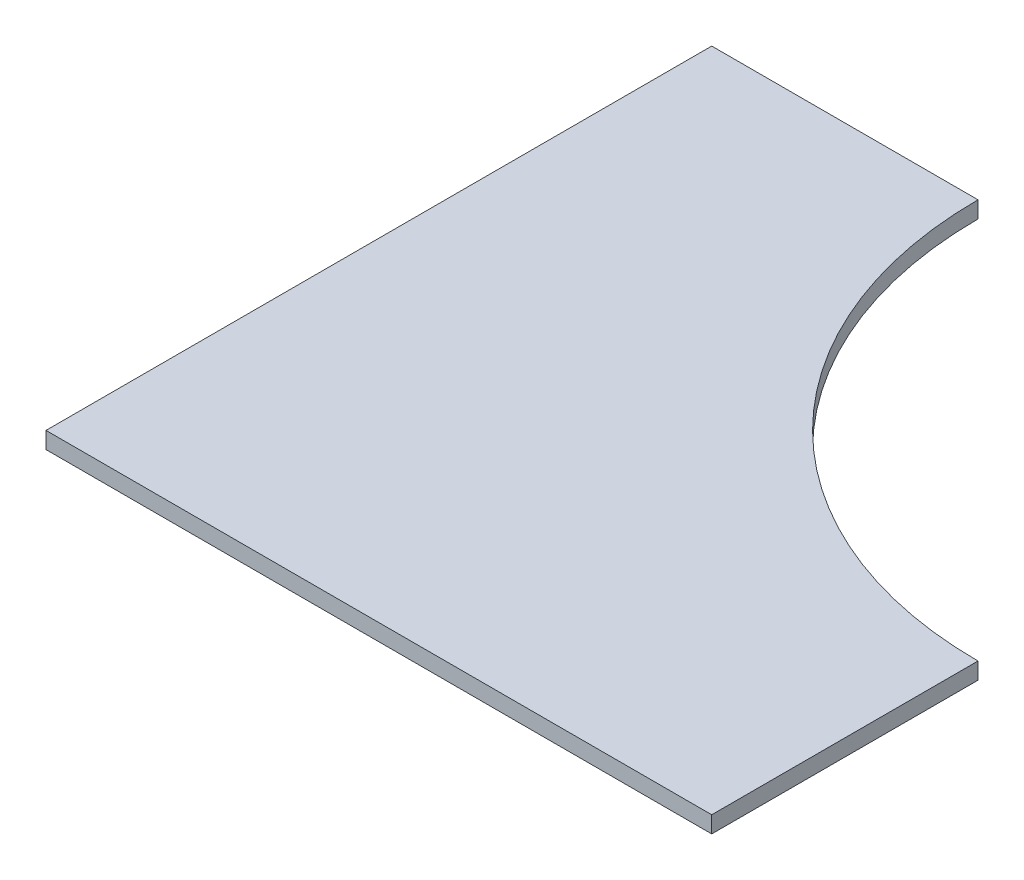
ISO-10303-21;
HEADER;
FILE_DESCRIPTION(('STEP AP214'),'2;1');
FILE_NAME('part.step','',(''),(''),'','','');
FILE_SCHEMA(('AUTOMOTIVE_DESIGN { 1 0 10303 214 1 1 1 1 }'));
ENDSEC;
DATA;
#1=APPLICATION_CONTEXT('core data for automotive mechanical design processes');
#2=APPLICATION_PROTOCOL_DEFINITION('international standard','automotive_design',2000,#1);
#3=PRODUCT_CONTEXT('',#1,'mechanical');
#4=PRODUCT('Part','Part','',(#3));
#5=PRODUCT_RELATED_PRODUCT_CATEGORY('part','',(#4));
#6=PRODUCT_DEFINITION_FORMATION('','',#4);
#7=PRODUCT_DEFINITION_CONTEXT('part definition',#1,'design');
#8=PRODUCT_DEFINITION('design','',#6,#7);
#9=PRODUCT_DEFINITION_SHAPE('','',#8);
#10=(LENGTH_UNIT() NAMED_UNIT(*) SI_UNIT(.MILLI.,.METRE.));
#11=(NAMED_UNIT(*) PLANE_ANGLE_UNIT() SI_UNIT($,.RADIAN.));
#12=(NAMED_UNIT(*) SI_UNIT($,.STERADIAN.) SOLID_ANGLE_UNIT());
#13=UNCERTAINTY_MEASURE_WITH_UNIT(LENGTH_MEASURE(1.E-05),#10,'distance_accuracy_value','');
#14=(GEOMETRIC_REPRESENTATION_CONTEXT(3) GLOBAL_UNCERTAINTY_ASSIGNED_CONTEXT((#13)) GLOBAL_UNIT_ASSIGNED_CONTEXT((#10,
#11,#12)) REPRESENTATION_CONTEXT('',''));
#15=CARTESIAN_POINT('',(0.,0.,0.));
#16=DIRECTION('',(0.,0.,1.));
#17=DIRECTION('',(1.,0.,0.));
#18=AXIS2_PLACEMENT_3D('',#15,#16,#17);
#19=CARTESIAN_POINT('',(0.,3.175,0.));
#20=DIRECTION('',(0.,0.,1.));
#21=DIRECTION('',(-1.,0.,0.));
#22=AXIS2_PLACEMENT_3D('',#19,#20,#21);
#23=PLANE('',#22);
#24=DIRECTION('',(1.,0.,0.));
#25=VECTOR('',#24,1.);
#26=CARTESIAN_POINT('',(0.,0.,0.));
#27=LINE('',#26,#25);
#28=CARTESIAN_POINT('',(0.,0.,0.));
#29=VERTEX_POINT('',#28);
#30=CARTESIAN_POINT('',(50.8,0.,0.));
#31=VERTEX_POINT('',#30);
#32=EDGE_CURVE('E112',#29,#31,#27,.T.);
#33=ORIENTED_EDGE('',*,*,#32,.F.);
#34=DIRECTION('',(0.,-1.,0.));
#35=VECTOR('',#34,1.);
#36=CARTESIAN_POINT('',(0.,3.175,0.));
#37=LINE('',#36,#35);
#38=CARTESIAN_POINT('',(0.,3.175,0.));
#39=VERTEX_POINT('',#38);
#40=EDGE_CURVE('E111',#39,#29,#37,.T.);
#41=ORIENTED_EDGE('',*,*,#40,.F.);
#42=DIRECTION('',(1.,0.,0.));
#43=VECTOR('',#42,1.);
#44=CARTESIAN_POINT('',(0.,3.175,0.));
#45=LINE('',#44,#43);
#46=CARTESIAN_POINT('',(50.8,3.175,0.));
#47=VERTEX_POINT('',#46);
#48=EDGE_CURVE('E106',#39,#47,#45,.T.);
#49=ORIENTED_EDGE('',*,*,#48,.T.);
#50=DIRECTION('',(0.,-1.,0.));
#51=VECTOR('',#50,1.);
#52=CARTESIAN_POINT('',(50.8,3.175,0.));
#53=LINE('',#52,#51);
#54=EDGE_CURVE('E11',#47,#31,#53,.T.);
#55=ORIENTED_EDGE('',*,*,#54,.T.);
#56=EDGE_LOOP('',(#33,#41,#49,#55));
#57=FACE_BOUND('',#56,.T.);
#58=ADVANCED_FACE('F37',(#57),#23,.F.);
#59=CARTESIAN_POINT('',(127.,3.175,0.));
#60=DIRECTION('',(0.,-1.,0.));
#61=DIRECTION('',(0.,0.,1.));
#62=AXIS2_PLACEMENT_3D('',#59,#60,#61);
#63=CYLINDRICAL_SURFACE('',#62,76.2);
#64=CARTESIAN_POINT('',(127.,0.,0.));
#65=DIRECTION('',(0.,1.,0.));
#66=DIRECTION('',(0.,0.,1.));
#67=AXIS2_PLACEMENT_3D('',#64,#65,#66);
#68=CIRCLE('',#67,76.2);
#69=CARTESIAN_POINT('',(127.,0.,76.2));
#70=VERTEX_POINT('',#69);
#71=EDGE_CURVE('E114',#31,#70,#68,.T.);
#72=ORIENTED_EDGE('',*,*,#71,.F.);
#73=ORIENTED_EDGE('',*,*,#54,.F.);
#74=CARTESIAN_POINT('',(127.,3.175,0.));
#75=DIRECTION('',(0.,1.,0.));
#76=DIRECTION('',(0.,0.,1.));
#77=AXIS2_PLACEMENT_3D('',#74,#75,#76);
#78=CIRCLE('',#77,76.2);
#79=CARTESIAN_POINT('',(127.,3.175,76.2));
#80=VERTEX_POINT('',#79);
#81=EDGE_CURVE('E82',#47,#80,#78,.T.);
#82=ORIENTED_EDGE('',*,*,#81,.T.);
#83=DIRECTION('',(0.,-1.,0.));
#84=VECTOR('',#83,1.);
#85=CARTESIAN_POINT('',(127.,3.175,76.2));
#86=LINE('',#85,#84);
#87=EDGE_CURVE('E45',#80,#70,#86,.T.);
#88=ORIENTED_EDGE('',*,*,#87,.T.);
#89=EDGE_LOOP('',(#72,#73,#82,#88));
#90=FACE_BOUND('',#89,.T.);
#91=ADVANCED_FACE('F123',(#90),#63,.F.);
#92=CARTESIAN_POINT('',(127.,3.175,127.));
#93=DIRECTION('',(-1.,0.,0.));
#94=DIRECTION('',(0.,0.,-1.));
#95=AXIS2_PLACEMENT_3D('',#92,#93,#94);
#96=PLANE('',#95);
#97=DIRECTION('',(0.,0.,1.));
#98=VECTOR('',#97,1.);
#99=CARTESIAN_POINT('',(127.,0.,127.));
#100=LINE('',#99,#98);
#101=CARTESIAN_POINT('',(127.,0.,127.));
#102=VERTEX_POINT('',#101);
#103=EDGE_CURVE('E117',#70,#102,#100,.T.);
#104=ORIENTED_EDGE('',*,*,#103,.F.);
#105=ORIENTED_EDGE('',*,*,#87,.F.);
#106=DIRECTION('',(0.,0.,1.));
#107=VECTOR('',#106,1.);
#108=CARTESIAN_POINT('',(127.,3.175,127.));
#109=LINE('',#108,#107);
#110=CARTESIAN_POINT('',(127.,3.175,127.));
#111=VERTEX_POINT('',#110);
#112=EDGE_CURVE('E91',#80,#111,#109,.T.);
#113=ORIENTED_EDGE('',*,*,#112,.T.);
#114=DIRECTION('',(0.,-1.,0.));
#115=VECTOR('',#114,1.);
#116=CARTESIAN_POINT('',(127.,3.175,127.));
#117=LINE('',#116,#115);
#118=EDGE_CURVE('E96',#111,#102,#117,.T.);
#119=ORIENTED_EDGE('',*,*,#118,.T.);
#120=EDGE_LOOP('',(#104,#105,#113,#119));
#121=FACE_BOUND('',#120,.T.);
#122=ADVANCED_FACE('F103',(#121),#96,.F.);
#123=CARTESIAN_POINT('',(0.,3.175,127.));
#124=DIRECTION('',(0.,0.,-1.));
#125=DIRECTION('',(1.,0.,0.));
#126=AXIS2_PLACEMENT_3D('',#123,#124,#125);
#127=PLANE('',#126);
#128=DIRECTION('',(-1.,0.,0.));
#129=VECTOR('',#128,1.);
#130=CARTESIAN_POINT('',(0.,0.,127.));
#131=LINE('',#130,#129);
#132=CARTESIAN_POINT('',(0.,0.,127.));
#133=VERTEX_POINT('',#132);
#134=EDGE_CURVE('E98',#102,#133,#131,.T.);
#135=ORIENTED_EDGE('',*,*,#134,.F.);
#136=ORIENTED_EDGE('',*,*,#118,.F.);
#137=DIRECTION('',(-1.,0.,0.));
#138=VECTOR('',#137,1.);
#139=CARTESIAN_POINT('',(0.,3.175,127.));
#140=LINE('',#139,#138);
#141=CARTESIAN_POINT('',(0.,3.175,127.));
#142=VERTEX_POINT('',#141);
#143=EDGE_CURVE('E87',#111,#142,#140,.T.);
#144=ORIENTED_EDGE('',*,*,#143,.T.);
#145=DIRECTION('',(0.,-1.,0.));
#146=VECTOR('',#145,1.);
#147=CARTESIAN_POINT('',(0.,3.175,127.));
#148=LINE('',#147,#146);
#149=EDGE_CURVE('E101',#142,#133,#148,.T.);
#150=ORIENTED_EDGE('',*,*,#149,.T.);
#151=EDGE_LOOP('',(#135,#136,#144,#150));
#152=FACE_BOUND('',#151,.T.);
#153=ADVANCED_FACE('F97',(#152),#127,.F.);
#154=CARTESIAN_POINT('',(0.,3.175,0.));
#155=DIRECTION('',(1.,0.,0.));
#156=DIRECTION('',(0.,0.,1.));
#157=AXIS2_PLACEMENT_3D('',#154,#155,#156);
#158=PLANE('',#157);
#159=DIRECTION('',(0.,0.,-1.));
#160=VECTOR('',#159,1.);
#161=CARTESIAN_POINT('',(0.,0.,0.));
#162=LINE('',#161,#160);
#163=EDGE_CURVE('E70',#133,#29,#162,.T.);
#164=ORIENTED_EDGE('',*,*,#163,.F.);
#165=ORIENTED_EDGE('',*,*,#149,.F.);
#166=DIRECTION('',(0.,0.,-1.));
#167=VECTOR('',#166,1.);
#168=CARTESIAN_POINT('',(0.,3.175,0.));
#169=LINE('',#168,#167);
#170=EDGE_CURVE('E53',#142,#39,#169,.T.);
#171=ORIENTED_EDGE('',*,*,#170,.T.);
#172=ORIENTED_EDGE('',*,*,#40,.T.);
#173=EDGE_LOOP('',(#164,#165,#171,#172));
#174=FACE_BOUND('',#173,.T.);
#175=ADVANCED_FACE('F129',(#174),#158,.F.);
#176=CARTESIAN_POINT('',(127.,3.175,0.));
#177=DIRECTION('',(0.,-1.,0.));
#178=DIRECTION('',(0.,0.,1.));
#179=AXIS2_PLACEMENT_3D('',#176,#177,#178);
#180=PLANE('',#179);
#181=ORIENTED_EDGE('',*,*,#48,.F.);
#182=ORIENTED_EDGE('',*,*,#170,.F.);
#183=ORIENTED_EDGE('',*,*,#143,.F.);
#184=ORIENTED_EDGE('',*,*,#112,.F.);
#185=ORIENTED_EDGE('',*,*,#81,.F.);
#186=EDGE_LOOP('',(#181,#182,#183,#184,#185));
#187=FACE_BOUND('',#186,.T.);
#188=ADVANCED_FACE('F89',(#187),#180,.F.);
#189=CARTESIAN_POINT('',(127.,0.,0.));
#190=DIRECTION('',(0.,-1.,0.));
#191=DIRECTION('',(0.,0.,1.));
#192=AXIS2_PLACEMENT_3D('',#189,#190,#191);
#193=PLANE('',#192);
#194=ORIENTED_EDGE('',*,*,#32,.T.);
#195=ORIENTED_EDGE('',*,*,#71,.T.);
#196=ORIENTED_EDGE('',*,*,#103,.T.);
#197=ORIENTED_EDGE('',*,*,#134,.T.);
#198=ORIENTED_EDGE('',*,*,#163,.T.);
#199=EDGE_LOOP('',(#194,#195,#196,#197,#198));
#200=FACE_BOUND('',#199,.T.);
#201=ADVANCED_FACE('F124',(#200),#193,.T.);
#202=CLOSED_SHELL('',(#58,#91,#122,#153,#175,#188,#201));
#203=MANIFOLD_SOLID_BREP('B2',#202);
#204=ADVANCED_BREP_SHAPE_REPRESENTATION('',(#18,#203),#14);
#205=SHAPE_DEFINITION_REPRESENTATION(#9,#204);
ENDSEC;
END-ISO-10303-21;
